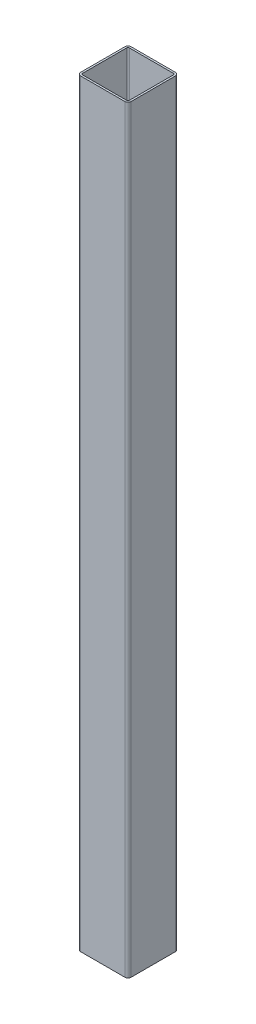
ISO-10303-21;
HEADER;
FILE_DESCRIPTION(('STEP AP214'),'2;1');
FILE_NAME('part.step','',(''),(''),'','','');
FILE_SCHEMA(('AUTOMOTIVE_DESIGN { 1 0 10303 214 1 1 1 1 }'));
ENDSEC;
DATA;
#1=APPLICATION_CONTEXT('core data for automotive mechanical design processes');
#2=APPLICATION_PROTOCOL_DEFINITION('international standard','automotive_design',2000,#1);
#3=PRODUCT_CONTEXT('',#1,'mechanical');
#4=PRODUCT('Part','Part','',(#3));
#5=PRODUCT_RELATED_PRODUCT_CATEGORY('part','',(#4));
#6=PRODUCT_DEFINITION_FORMATION('','',#4);
#7=PRODUCT_DEFINITION_CONTEXT('part definition',#1,'design');
#8=PRODUCT_DEFINITION('design','',#6,#7);
#9=PRODUCT_DEFINITION_SHAPE('','',#8);
#10=(LENGTH_UNIT() NAMED_UNIT(*) SI_UNIT(.MILLI.,.METRE.));
#11=(NAMED_UNIT(*) PLANE_ANGLE_UNIT() SI_UNIT($,.RADIAN.));
#12=(NAMED_UNIT(*) SI_UNIT($,.STERADIAN.) SOLID_ANGLE_UNIT());
#13=UNCERTAINTY_MEASURE_WITH_UNIT(LENGTH_MEASURE(1.E-05),#10,'distance_accuracy_value','');
#14=(GEOMETRIC_REPRESENTATION_CONTEXT(3) GLOBAL_UNCERTAINTY_ASSIGNED_CONTEXT((#13)) GLOBAL_UNIT_ASSIGNED_CONTEXT((#10,
#11,#12)) REPRESENTATION_CONTEXT('',''));
#15=CARTESIAN_POINT('',(0.,0.,0.));
#16=DIRECTION('',(0.,0.,1.));
#17=DIRECTION('',(1.,0.,0.));
#18=AXIS2_PLACEMENT_3D('',#15,#16,#17);
#19=CARTESIAN_POINT('',(35.,1200.,35.));
#20=DIRECTION('',(0.,1.,0.));
#21=DIRECTION('',(0.,0.,1.));
#22=AXIS2_PLACEMENT_3D('',#19,#20,#21);
#23=PLANE('',#22);
#24=CARTESIAN_POINT('',(35.,1200.,35.));
#25=DIRECTION('',(0.,1.,0.));
#26=DIRECTION('',(0.,0.,1.));
#27=AXIS2_PLACEMENT_3D('',#24,#25,#26);
#28=CIRCLE('',#27,5.);
#29=CARTESIAN_POINT('',(35.,1200.,40.));
#30=VERTEX_POINT('',#29);
#31=CARTESIAN_POINT('',(40.,1200.,35.));
#32=VERTEX_POINT('',#31);
#33=EDGE_CURVE('E263',#30,#32,#28,.T.);
#34=ORIENTED_EDGE('',*,*,#33,.T.);
#35=DIRECTION('',(0.,0.,-1.));
#36=VECTOR('',#35,1.);
#37=CARTESIAN_POINT('',(40.,1200.,-35.));
#38=LINE('',#37,#36);
#39=CARTESIAN_POINT('',(40.,1200.,-35.));
#40=VERTEX_POINT('',#39);
#41=EDGE_CURVE('E266',#32,#40,#38,.T.);
#42=ORIENTED_EDGE('',*,*,#41,.T.);
#43=CARTESIAN_POINT('',(35.,1200.,-35.));
#44=DIRECTION('',(0.,1.,0.));
#45=DIRECTION('',(0.,0.,-1.));
#46=AXIS2_PLACEMENT_3D('',#43,#44,#45);
#47=CIRCLE('',#46,5.);
#48=CARTESIAN_POINT('',(35.,1200.,-40.));
#49=VERTEX_POINT('',#48);
#50=EDGE_CURVE('E269',#40,#49,#47,.T.);
#51=ORIENTED_EDGE('',*,*,#50,.T.);
#52=DIRECTION('',(-1.,0.,0.));
#53=VECTOR('',#52,1.);
#54=CARTESIAN_POINT('',(-35.,1200.,-40.));
#55=LINE('',#54,#53);
#56=CARTESIAN_POINT('',(-35.,1200.,-40.));
#57=VERTEX_POINT('',#56);
#58=EDGE_CURVE('E271',#49,#57,#55,.T.);
#59=ORIENTED_EDGE('',*,*,#58,.T.);
#60=CARTESIAN_POINT('',(-35.,1200.,-35.));
#61=DIRECTION('',(0.,1.,0.));
#62=DIRECTION('',(0.,0.,1.));
#63=AXIS2_PLACEMENT_3D('',#60,#61,#62);
#64=CIRCLE('',#63,5.);
#65=CARTESIAN_POINT('',(-40.,1200.,-35.));
#66=VERTEX_POINT('',#65);
#67=EDGE_CURVE('E273',#57,#66,#64,.T.);
#68=ORIENTED_EDGE('',*,*,#67,.T.);
#69=DIRECTION('',(0.,0.,1.));
#70=VECTOR('',#69,1.);
#71=CARTESIAN_POINT('',(-40.,1200.,-35.));
#72=LINE('',#71,#70);
#73=CARTESIAN_POINT('',(-40.,1200.,35.));
#74=VERTEX_POINT('',#73);
#75=EDGE_CURVE('E275',#66,#74,#72,.T.);
#76=ORIENTED_EDGE('',*,*,#75,.T.);
#77=CARTESIAN_POINT('',(-35.,1200.,35.));
#78=DIRECTION('',(0.,1.,0.));
#79=DIRECTION('',(0.,0.,1.));
#80=AXIS2_PLACEMENT_3D('',#77,#78,#79);
#81=CIRCLE('',#80,5.);
#82=CARTESIAN_POINT('',(-35.,1200.,40.));
#83=VERTEX_POINT('',#82);
#84=EDGE_CURVE('E277',#74,#83,#81,.T.);
#85=ORIENTED_EDGE('',*,*,#84,.T.);
#86=DIRECTION('',(1.,0.,0.));
#87=VECTOR('',#86,1.);
#88=CARTESIAN_POINT('',(-35.,1200.,40.));
#89=LINE('',#88,#87);
#90=EDGE_CURVE('E279',#83,#30,#89,.T.);
#91=ORIENTED_EDGE('',*,*,#90,.T.);
#92=EDGE_LOOP('',(#34,#42,#51,#59,#68,#76,#85,#91));
#93=FACE_BOUND('',#92,.T.);
#94=DIRECTION('',(0.,0.,-1.));
#95=VECTOR('',#94,1.);
#96=CARTESIAN_POINT('',(37.,1200.,-35.));
#97=LINE('',#96,#95);
#98=CARTESIAN_POINT('',(37.,1200.,35.));
#99=VERTEX_POINT('',#98);
#100=CARTESIAN_POINT('',(37.,1200.,-35.));
#101=VERTEX_POINT('',#100);
#102=EDGE_CURVE('E206',#99,#101,#97,.T.);
#103=ORIENTED_EDGE('',*,*,#102,.F.);
#104=CARTESIAN_POINT('',(35.,1200.,35.));
#105=DIRECTION('',(0.,1.,0.));
#106=DIRECTION('',(1.,0.,0.));
#107=AXIS2_PLACEMENT_3D('',#104,#105,#106);
#108=CIRCLE('',#107,2.);
#109=CARTESIAN_POINT('',(35.,1200.,37.));
#110=VERTEX_POINT('',#109);
#111=EDGE_CURVE('E198',#110,#99,#108,.T.);
#112=ORIENTED_EDGE('',*,*,#111,.F.);
#113=DIRECTION('',(1.,0.,0.));
#114=VECTOR('',#113,1.);
#115=CARTESIAN_POINT('',(-35.,1200.,37.));
#116=LINE('',#115,#114);
#117=CARTESIAN_POINT('',(-35.,1200.,37.));
#118=VERTEX_POINT('',#117);
#119=EDGE_CURVE('E231',#118,#110,#116,.T.);
#120=ORIENTED_EDGE('',*,*,#119,.F.);
#121=CARTESIAN_POINT('',(-35.,1200.,35.));
#122=DIRECTION('',(0.,1.,0.));
#123=DIRECTION('',(1.,0.,0.));
#124=AXIS2_PLACEMENT_3D('',#121,#122,#123);
#125=CIRCLE('',#124,2.);
#126=CARTESIAN_POINT('',(-37.,1200.,35.));
#127=VERTEX_POINT('',#126);
#128=EDGE_CURVE('E229',#127,#118,#125,.T.);
#129=ORIENTED_EDGE('',*,*,#128,.F.);
#130=DIRECTION('',(0.,0.,1.));
#131=VECTOR('',#130,1.);
#132=CARTESIAN_POINT('',(-37.,1200.,-35.));
#133=LINE('',#132,#131);
#134=CARTESIAN_POINT('',(-37.,1200.,-35.));
#135=VERTEX_POINT('',#134);
#136=EDGE_CURVE('E227',#135,#127,#133,.T.);
#137=ORIENTED_EDGE('',*,*,#136,.F.);
#138=CARTESIAN_POINT('',(-35.,1200.,-35.));
#139=DIRECTION('',(0.,1.,0.));
#140=DIRECTION('',(1.,0.,0.));
#141=AXIS2_PLACEMENT_3D('',#138,#139,#140);
#142=CIRCLE('',#141,2.);
#143=CARTESIAN_POINT('',(-35.,1200.,-37.));
#144=VERTEX_POINT('',#143);
#145=EDGE_CURVE('E225',#144,#135,#142,.T.);
#146=ORIENTED_EDGE('',*,*,#145,.F.);
#147=DIRECTION('',(-1.,0.,0.));
#148=VECTOR('',#147,1.);
#149=CARTESIAN_POINT('',(-35.,1200.,-37.));
#150=LINE('',#149,#148);
#151=CARTESIAN_POINT('',(35.,1200.,-37.));
#152=VERTEX_POINT('',#151);
#153=EDGE_CURVE('E221',#152,#144,#150,.T.);
#154=ORIENTED_EDGE('',*,*,#153,.F.);
#155=CARTESIAN_POINT('',(35.,1200.,-35.));
#156=DIRECTION('',(0.,1.,0.));
#157=DIRECTION('',(1.,0.,0.));
#158=AXIS2_PLACEMENT_3D('',#155,#156,#157);
#159=CIRCLE('',#158,2.);
#160=EDGE_CURVE('E219',#101,#152,#159,.T.);
#161=ORIENTED_EDGE('',*,*,#160,.F.);
#162=EDGE_LOOP('',(#103,#112,#120,#129,#137,#146,#154,#161));
#163=FACE_BOUND('',#162,.T.);
#164=ADVANCED_FACE('F85',(#93,#163),#23,.T.);
#165=CARTESIAN_POINT('',(35.,0.,35.));
#166=DIRECTION('',(0.,1.,0.));
#167=DIRECTION('',(0.,0.,1.));
#168=AXIS2_PLACEMENT_3D('',#165,#166,#167);
#169=PLANE('',#168);
#170=CARTESIAN_POINT('',(35.,0.,35.));
#171=DIRECTION('',(0.,1.,0.));
#172=DIRECTION('',(0.,0.,1.));
#173=AXIS2_PLACEMENT_3D('',#170,#171,#172);
#174=CIRCLE('',#173,5.);
#175=CARTESIAN_POINT('',(35.,0.,40.));
#176=VERTEX_POINT('',#175);
#177=CARTESIAN_POINT('',(40.,0.,35.));
#178=VERTEX_POINT('',#177);
#179=EDGE_CURVE('E214',#176,#178,#174,.T.);
#180=ORIENTED_EDGE('',*,*,#179,.F.);
#181=DIRECTION('',(1.,0.,0.));
#182=VECTOR('',#181,1.);
#183=CARTESIAN_POINT('',(-35.,0.,40.));
#184=LINE('',#183,#182);
#185=CARTESIAN_POINT('',(-35.,0.,40.));
#186=VERTEX_POINT('',#185);
#187=EDGE_CURVE('E267',#186,#176,#184,.T.);
#188=ORIENTED_EDGE('',*,*,#187,.F.);
#189=CARTESIAN_POINT('',(-35.,0.,35.));
#190=DIRECTION('',(0.,1.,0.));
#191=DIRECTION('',(0.,0.,1.));
#192=AXIS2_PLACEMENT_3D('',#189,#190,#191);
#193=CIRCLE('',#192,5.);
#194=CARTESIAN_POINT('',(-40.,0.,35.));
#195=VERTEX_POINT('',#194);
#196=EDGE_CURVE('E294',#195,#186,#193,.T.);
#197=ORIENTED_EDGE('',*,*,#196,.F.);
#198=DIRECTION('',(0.,0.,1.));
#199=VECTOR('',#198,1.);
#200=CARTESIAN_POINT('',(-40.,0.,-35.));
#201=LINE('',#200,#199);
#202=CARTESIAN_POINT('',(-40.,0.,-35.));
#203=VERTEX_POINT('',#202);
#204=EDGE_CURVE('E292',#203,#195,#201,.T.);
#205=ORIENTED_EDGE('',*,*,#204,.F.);
#206=CARTESIAN_POINT('',(-35.,0.,-35.));
#207=DIRECTION('',(0.,1.,0.));
#208=DIRECTION('',(0.,0.,1.));
#209=AXIS2_PLACEMENT_3D('',#206,#207,#208);
#210=CIRCLE('',#209,5.);
#211=CARTESIAN_POINT('',(-35.,0.,-40.));
#212=VERTEX_POINT('',#211);
#213=EDGE_CURVE('E290',#212,#203,#210,.T.);
#214=ORIENTED_EDGE('',*,*,#213,.F.);
#215=DIRECTION('',(-1.,0.,0.));
#216=VECTOR('',#215,1.);
#217=CARTESIAN_POINT('',(-35.,0.,-40.));
#218=LINE('',#217,#216);
#219=CARTESIAN_POINT('',(35.,0.,-40.));
#220=VERTEX_POINT('',#219);
#221=EDGE_CURVE('E288',#220,#212,#218,.T.);
#222=ORIENTED_EDGE('',*,*,#221,.F.);
#223=CARTESIAN_POINT('',(35.,0.,-35.));
#224=DIRECTION('',(0.,1.,0.));
#225=DIRECTION('',(0.,0.,-1.));
#226=AXIS2_PLACEMENT_3D('',#223,#224,#225);
#227=CIRCLE('',#226,5.);
#228=CARTESIAN_POINT('',(40.,0.,-35.));
#229=VERTEX_POINT('',#228);
#230=EDGE_CURVE('E286',#229,#220,#227,.T.);
#231=ORIENTED_EDGE('',*,*,#230,.F.);
#232=DIRECTION('',(0.,0.,-1.));
#233=VECTOR('',#232,1.);
#234=CARTESIAN_POINT('',(40.,0.,-35.));
#235=LINE('',#234,#233);
#236=EDGE_CURVE('E284',#178,#229,#235,.T.);
#237=ORIENTED_EDGE('',*,*,#236,.F.);
#238=EDGE_LOOP('',(#180,#188,#197,#205,#214,#222,#231,#237));
#239=FACE_BOUND('',#238,.T.);
#240=CARTESIAN_POINT('',(35.,0.,35.));
#241=DIRECTION('',(0.,1.,0.));
#242=DIRECTION('',(1.,0.,0.));
#243=AXIS2_PLACEMENT_3D('',#240,#241,#242);
#244=CIRCLE('',#243,2.);
#245=CARTESIAN_POINT('',(35.,0.,37.));
#246=VERTEX_POINT('',#245);
#247=CARTESIAN_POINT('',(37.,0.,35.));
#248=VERTEX_POINT('',#247);
#249=EDGE_CURVE('E108',#246,#248,#244,.T.);
#250=ORIENTED_EDGE('',*,*,#249,.T.);
#251=DIRECTION('',(0.,0.,-1.));
#252=VECTOR('',#251,1.);
#253=CARTESIAN_POINT('',(37.,0.,-35.));
#254=LINE('',#253,#252);
#255=CARTESIAN_POINT('',(37.,0.,-35.));
#256=VERTEX_POINT('',#255);
#257=EDGE_CURVE('E213',#248,#256,#254,.T.);
#258=ORIENTED_EDGE('',*,*,#257,.T.);
#259=CARTESIAN_POINT('',(35.,0.,-35.));
#260=DIRECTION('',(0.,1.,0.));
#261=DIRECTION('',(1.,0.,0.));
#262=AXIS2_PLACEMENT_3D('',#259,#260,#261);
#263=CIRCLE('',#262,2.);
#264=CARTESIAN_POINT('',(35.,0.,-37.));
#265=VERTEX_POINT('',#264);
#266=EDGE_CURVE('E235',#256,#265,#263,.T.);
#267=ORIENTED_EDGE('',*,*,#266,.T.);
#268=DIRECTION('',(-1.,0.,0.));
#269=VECTOR('',#268,1.);
#270=CARTESIAN_POINT('',(-35.,0.,-37.));
#271=LINE('',#270,#269);
#272=CARTESIAN_POINT('',(-35.,0.,-37.));
#273=VERTEX_POINT('',#272);
#274=EDGE_CURVE('E238',#265,#273,#271,.T.);
#275=ORIENTED_EDGE('',*,*,#274,.T.);
#276=CARTESIAN_POINT('',(-35.,0.,-35.));
#277=DIRECTION('',(0.,1.,0.));
#278=DIRECTION('',(1.,0.,0.));
#279=AXIS2_PLACEMENT_3D('',#276,#277,#278);
#280=CIRCLE('',#279,2.);
#281=CARTESIAN_POINT('',(-37.,0.,-35.));
#282=VERTEX_POINT('',#281);
#283=EDGE_CURVE('E241',#273,#282,#280,.T.);
#284=ORIENTED_EDGE('',*,*,#283,.T.);
#285=DIRECTION('',(0.,0.,1.));
#286=VECTOR('',#285,1.);
#287=CARTESIAN_POINT('',(-37.,0.,-35.));
#288=LINE('',#287,#286);
#289=CARTESIAN_POINT('',(-37.,0.,35.));
#290=VERTEX_POINT('',#289);
#291=EDGE_CURVE('E244',#282,#290,#288,.T.);
#292=ORIENTED_EDGE('',*,*,#291,.T.);
#293=CARTESIAN_POINT('',(-35.,0.,35.));
#294=DIRECTION('',(0.,1.,0.));
#295=DIRECTION('',(1.,0.,0.));
#296=AXIS2_PLACEMENT_3D('',#293,#294,#295);
#297=CIRCLE('',#296,2.);
#298=CARTESIAN_POINT('',(-35.,0.,37.));
#299=VERTEX_POINT('',#298);
#300=EDGE_CURVE('E247',#290,#299,#297,.T.);
#301=ORIENTED_EDGE('',*,*,#300,.T.);
#302=DIRECTION('',(1.,0.,0.));
#303=VECTOR('',#302,1.);
#304=CARTESIAN_POINT('',(-35.,0.,37.));
#305=LINE('',#304,#303);
#306=EDGE_CURVE('E207',#299,#246,#305,.T.);
#307=ORIENTED_EDGE('',*,*,#306,.T.);
#308=EDGE_LOOP('',(#250,#258,#267,#275,#284,#292,#301,#307));
#309=FACE_BOUND('',#308,.T.);
#310=ADVANCED_FACE('F324',(#239,#309),#169,.F.);
#311=CARTESIAN_POINT('',(35.,1200.,35.));
#312=DIRECTION('',(0.,-1.,0.));
#313=DIRECTION('',(0.,0.,-1.));
#314=AXIS2_PLACEMENT_3D('',#311,#312,#313);
#315=CYLINDRICAL_SURFACE('',#314,5.);
#316=ORIENTED_EDGE('',*,*,#179,.T.);
#317=DIRECTION('',(0.,-1.,0.));
#318=VECTOR('',#317,1.);
#319=CARTESIAN_POINT('',(40.,1200.,35.));
#320=LINE('',#319,#318);
#321=EDGE_CURVE('E12',#32,#178,#320,.T.);
#322=ORIENTED_EDGE('',*,*,#321,.F.);
#323=ORIENTED_EDGE('',*,*,#33,.F.);
#324=DIRECTION('',(0.,-1.,0.));
#325=VECTOR('',#324,1.);
#326=CARTESIAN_POINT('',(35.,1200.,40.));
#327=LINE('',#326,#325);
#328=EDGE_CURVE('E281',#30,#176,#327,.T.);
#329=ORIENTED_EDGE('',*,*,#328,.T.);
#330=EDGE_LOOP('',(#316,#322,#323,#329));
#331=FACE_BOUND('',#330,.T.);
#332=ADVANCED_FACE('F87',(#331),#315,.T.);
#333=CARTESIAN_POINT('',(40.,1200.,-35.));
#334=DIRECTION('',(-1.,0.,0.));
#335=DIRECTION('',(0.,0.,1.));
#336=AXIS2_PLACEMENT_3D('',#333,#334,#335);
#337=PLANE('',#336);
#338=ORIENTED_EDGE('',*,*,#236,.T.);
#339=DIRECTION('',(0.,-1.,0.));
#340=VECTOR('',#339,1.);
#341=CARTESIAN_POINT('',(40.,1200.,-35.));
#342=LINE('',#341,#340);
#343=EDGE_CURVE('E93',#40,#229,#342,.T.);
#344=ORIENTED_EDGE('',*,*,#343,.F.);
#345=ORIENTED_EDGE('',*,*,#41,.F.);
#346=ORIENTED_EDGE('',*,*,#321,.T.);
#347=EDGE_LOOP('',(#338,#344,#345,#346));
#348=FACE_BOUND('',#347,.T.);
#349=ADVANCED_FACE('F341',(#348),#337,.F.);
#350=CARTESIAN_POINT('',(35.,1200.,-35.));
#351=DIRECTION('',(0.,-1.,0.));
#352=DIRECTION('',(0.,0.,-1.));
#353=AXIS2_PLACEMENT_3D('',#350,#351,#352);
#354=CYLINDRICAL_SURFACE('',#353,5.);
#355=ORIENTED_EDGE('',*,*,#230,.T.);
#356=DIRECTION('',(0.,-1.,0.));
#357=VECTOR('',#356,1.);
#358=CARTESIAN_POINT('',(35.,1200.,-40.));
#359=LINE('',#358,#357);
#360=EDGE_CURVE('E311',#49,#220,#359,.T.);
#361=ORIENTED_EDGE('',*,*,#360,.F.);
#362=ORIENTED_EDGE('',*,*,#50,.F.);
#363=ORIENTED_EDGE('',*,*,#343,.T.);
#364=EDGE_LOOP('',(#355,#361,#362,#363));
#365=FACE_BOUND('',#364,.T.);
#366=ADVANCED_FACE('F318',(#365),#354,.T.);
#367=CARTESIAN_POINT('',(-35.,1200.,-40.));
#368=DIRECTION('',(0.,0.,1.));
#369=DIRECTION('',(1.,0.,0.));
#370=AXIS2_PLACEMENT_3D('',#367,#368,#369);
#371=PLANE('',#370);
#372=ORIENTED_EDGE('',*,*,#221,.T.);
#373=DIRECTION('',(0.,-1.,0.));
#374=VECTOR('',#373,1.);
#375=CARTESIAN_POINT('',(-35.,1200.,-40.));
#376=LINE('',#375,#374);
#377=EDGE_CURVE('E308',#57,#212,#376,.T.);
#378=ORIENTED_EDGE('',*,*,#377,.F.);
#379=ORIENTED_EDGE('',*,*,#58,.F.);
#380=ORIENTED_EDGE('',*,*,#360,.T.);
#381=EDGE_LOOP('',(#372,#378,#379,#380));
#382=FACE_BOUND('',#381,.T.);
#383=ADVANCED_FACE('F330',(#382),#371,.F.);
#384=CARTESIAN_POINT('',(-35.,1200.,-35.));
#385=DIRECTION('',(0.,-1.,0.));
#386=DIRECTION('',(0.,0.,-1.));
#387=AXIS2_PLACEMENT_3D('',#384,#385,#386);
#388=CYLINDRICAL_SURFACE('',#387,5.);
#389=ORIENTED_EDGE('',*,*,#213,.T.);
#390=DIRECTION('',(0.,-1.,0.));
#391=VECTOR('',#390,1.);
#392=CARTESIAN_POINT('',(-40.,1200.,-35.));
#393=LINE('',#392,#391);
#394=EDGE_CURVE('E305',#66,#203,#393,.T.);
#395=ORIENTED_EDGE('',*,*,#394,.F.);
#396=ORIENTED_EDGE('',*,*,#67,.F.);
#397=ORIENTED_EDGE('',*,*,#377,.T.);
#398=EDGE_LOOP('',(#389,#395,#396,#397));
#399=FACE_BOUND('',#398,.T.);
#400=ADVANCED_FACE('F334',(#399),#388,.T.);
#401=CARTESIAN_POINT('',(-40.,1200.,-35.));
#402=DIRECTION('',(1.,0.,0.));
#403=DIRECTION('',(0.,0.,-1.));
#404=AXIS2_PLACEMENT_3D('',#401,#402,#403);
#405=PLANE('',#404);
#406=ORIENTED_EDGE('',*,*,#204,.T.);
#407=DIRECTION('',(0.,-1.,0.));
#408=VECTOR('',#407,1.);
#409=CARTESIAN_POINT('',(-40.,1200.,35.));
#410=LINE('',#409,#408);
#411=EDGE_CURVE('E302',#74,#195,#410,.T.);
#412=ORIENTED_EDGE('',*,*,#411,.F.);
#413=ORIENTED_EDGE('',*,*,#75,.F.);
#414=ORIENTED_EDGE('',*,*,#394,.T.);
#415=EDGE_LOOP('',(#406,#412,#413,#414));
#416=FACE_BOUND('',#415,.T.);
#417=ADVANCED_FACE('F354',(#416),#405,.F.);
#418=CARTESIAN_POINT('',(-35.,1200.,35.));
#419=DIRECTION('',(0.,-1.,0.));
#420=DIRECTION('',(0.,0.,-1.));
#421=AXIS2_PLACEMENT_3D('',#418,#419,#420);
#422=CYLINDRICAL_SURFACE('',#421,5.);
#423=ORIENTED_EDGE('',*,*,#196,.T.);
#424=DIRECTION('',(0.,-1.,0.));
#425=VECTOR('',#424,1.);
#426=CARTESIAN_POINT('',(-35.,1200.,40.));
#427=LINE('',#426,#425);
#428=EDGE_CURVE('E299',#83,#186,#427,.T.);
#429=ORIENTED_EDGE('',*,*,#428,.F.);
#430=ORIENTED_EDGE('',*,*,#84,.F.);
#431=ORIENTED_EDGE('',*,*,#411,.T.);
#432=EDGE_LOOP('',(#423,#429,#430,#431));
#433=FACE_BOUND('',#432,.T.);
#434=ADVANCED_FACE('F352',(#433),#422,.T.);
#435=CARTESIAN_POINT('',(-35.,1200.,40.));
#436=DIRECTION('',(0.,0.,-1.));
#437=DIRECTION('',(-1.,0.,0.));
#438=AXIS2_PLACEMENT_3D('',#435,#436,#437);
#439=PLANE('',#438);
#440=ORIENTED_EDGE('',*,*,#187,.T.);
#441=ORIENTED_EDGE('',*,*,#328,.F.);
#442=ORIENTED_EDGE('',*,*,#90,.F.);
#443=ORIENTED_EDGE('',*,*,#428,.T.);
#444=EDGE_LOOP('',(#440,#441,#442,#443));
#445=FACE_BOUND('',#444,.T.);
#446=ADVANCED_FACE('F347',(#445),#439,.F.);
#447=CARTESIAN_POINT('',(35.,1200.,35.));
#448=DIRECTION('',(0.,-1.,0.));
#449=DIRECTION('',(0.,0.,-1.));
#450=AXIS2_PLACEMENT_3D('',#447,#448,#449);
#451=CYLINDRICAL_SURFACE('',#450,2.);
#452=ORIENTED_EDGE('',*,*,#249,.F.);
#453=DIRECTION('',(0.,-1.,0.));
#454=VECTOR('',#453,1.);
#455=CARTESIAN_POINT('',(35.,1200.,37.));
#456=LINE('',#455,#454);
#457=EDGE_CURVE('E202',#110,#246,#456,.T.);
#458=ORIENTED_EDGE('',*,*,#457,.F.);
#459=ORIENTED_EDGE('',*,*,#111,.T.);
#460=DIRECTION('',(0.,-1.,0.));
#461=VECTOR('',#460,1.);
#462=CARTESIAN_POINT('',(37.,1200.,35.));
#463=LINE('',#462,#461);
#464=EDGE_CURVE('E201',#99,#248,#463,.T.);
#465=ORIENTED_EDGE('',*,*,#464,.T.);
#466=EDGE_LOOP('',(#452,#458,#459,#465));
#467=FACE_BOUND('',#466,.T.);
#468=ADVANCED_FACE('F200',(#467),#451,.F.);
#469=CARTESIAN_POINT('',(37.,1200.,-35.));
#470=DIRECTION('',(-1.,0.,0.));
#471=DIRECTION('',(0.,0.,1.));
#472=AXIS2_PLACEMENT_3D('',#469,#470,#471);
#473=PLANE('',#472);
#474=ORIENTED_EDGE('',*,*,#257,.F.);
#475=ORIENTED_EDGE('',*,*,#464,.F.);
#476=ORIENTED_EDGE('',*,*,#102,.T.);
#477=DIRECTION('',(0.,-1.,0.));
#478=VECTOR('',#477,1.);
#479=CARTESIAN_POINT('',(37.,1200.,-35.));
#480=LINE('',#479,#478);
#481=EDGE_CURVE('E215',#101,#256,#480,.T.);
#482=ORIENTED_EDGE('',*,*,#481,.T.);
#483=EDGE_LOOP('',(#474,#475,#476,#482));
#484=FACE_BOUND('',#483,.T.);
#485=ADVANCED_FACE('F210',(#484),#473,.T.);
#486=CARTESIAN_POINT('',(35.,1200.,-35.));
#487=DIRECTION('',(0.,-1.,0.));
#488=DIRECTION('',(0.,0.,-1.));
#489=AXIS2_PLACEMENT_3D('',#486,#487,#488);
#490=CYLINDRICAL_SURFACE('',#489,2.);
#491=ORIENTED_EDGE('',*,*,#266,.F.);
#492=ORIENTED_EDGE('',*,*,#481,.F.);
#493=ORIENTED_EDGE('',*,*,#160,.T.);
#494=DIRECTION('',(0.,-1.,0.));
#495=VECTOR('',#494,1.);
#496=CARTESIAN_POINT('',(35.,1200.,-37.));
#497=LINE('',#496,#495);
#498=EDGE_CURVE('E260',#152,#265,#497,.T.);
#499=ORIENTED_EDGE('',*,*,#498,.T.);
#500=EDGE_LOOP('',(#491,#492,#493,#499));
#501=FACE_BOUND('',#500,.T.);
#502=ADVANCED_FACE('F379',(#501),#490,.F.);
#503=CARTESIAN_POINT('',(-35.,1200.,-37.));
#504=DIRECTION('',(0.,0.,1.));
#505=DIRECTION('',(1.,0.,0.));
#506=AXIS2_PLACEMENT_3D('',#503,#504,#505);
#507=PLANE('',#506);
#508=ORIENTED_EDGE('',*,*,#274,.F.);
#509=ORIENTED_EDGE('',*,*,#498,.F.);
#510=ORIENTED_EDGE('',*,*,#153,.T.);
#511=DIRECTION('',(0.,-1.,0.));
#512=VECTOR('',#511,1.);
#513=CARTESIAN_POINT('',(-35.,1200.,-37.));
#514=LINE('',#513,#512);
#515=EDGE_CURVE('E258',#144,#273,#514,.T.);
#516=ORIENTED_EDGE('',*,*,#515,.T.);
#517=EDGE_LOOP('',(#508,#509,#510,#516));
#518=FACE_BOUND('',#517,.T.);
#519=ADVANCED_FACE('F383',(#518),#507,.T.);
#520=CARTESIAN_POINT('',(-35.,1200.,-35.));
#521=DIRECTION('',(0.,-1.,0.));
#522=DIRECTION('',(0.,0.,-1.));
#523=AXIS2_PLACEMENT_3D('',#520,#521,#522);
#524=CYLINDRICAL_SURFACE('',#523,2.);
#525=ORIENTED_EDGE('',*,*,#283,.F.);
#526=ORIENTED_EDGE('',*,*,#515,.F.);
#527=ORIENTED_EDGE('',*,*,#145,.T.);
#528=DIRECTION('',(0.,-1.,0.));
#529=VECTOR('',#528,1.);
#530=CARTESIAN_POINT('',(-37.,1200.,-35.));
#531=LINE('',#530,#529);
#532=EDGE_CURVE('E256',#135,#282,#531,.T.);
#533=ORIENTED_EDGE('',*,*,#532,.T.);
#534=EDGE_LOOP('',(#525,#526,#527,#533));
#535=FACE_BOUND('',#534,.T.);
#536=ADVANCED_FACE('F389',(#535),#524,.F.);
#537=CARTESIAN_POINT('',(-37.,1200.,-35.));
#538=DIRECTION('',(1.,0.,0.));
#539=DIRECTION('',(0.,0.,-1.));
#540=AXIS2_PLACEMENT_3D('',#537,#538,#539);
#541=PLANE('',#540);
#542=ORIENTED_EDGE('',*,*,#291,.F.);
#543=ORIENTED_EDGE('',*,*,#532,.F.);
#544=ORIENTED_EDGE('',*,*,#136,.T.);
#545=DIRECTION('',(0.,-1.,0.));
#546=VECTOR('',#545,1.);
#547=CARTESIAN_POINT('',(-37.,1200.,35.));
#548=LINE('',#547,#546);
#549=EDGE_CURVE('E254',#127,#290,#548,.T.);
#550=ORIENTED_EDGE('',*,*,#549,.T.);
#551=EDGE_LOOP('',(#542,#543,#544,#550));
#552=FACE_BOUND('',#551,.T.);
#553=ADVANCED_FACE('F393',(#552),#541,.T.);
#554=CARTESIAN_POINT('',(-35.,1200.,35.));
#555=DIRECTION('',(0.,-1.,0.));
#556=DIRECTION('',(0.,0.,-1.));
#557=AXIS2_PLACEMENT_3D('',#554,#555,#556);
#558=CYLINDRICAL_SURFACE('',#557,2.);
#559=ORIENTED_EDGE('',*,*,#300,.F.);
#560=ORIENTED_EDGE('',*,*,#549,.F.);
#561=ORIENTED_EDGE('',*,*,#128,.T.);
#562=DIRECTION('',(0.,-1.,0.));
#563=VECTOR('',#562,1.);
#564=CARTESIAN_POINT('',(-35.,1200.,37.));
#565=LINE('',#564,#563);
#566=EDGE_CURVE('E100',#118,#299,#565,.T.);
#567=ORIENTED_EDGE('',*,*,#566,.T.);
#568=EDGE_LOOP('',(#559,#560,#561,#567));
#569=FACE_BOUND('',#568,.T.);
#570=ADVANCED_FACE('F397',(#569),#558,.F.);
#571=CARTESIAN_POINT('',(-35.,1200.,37.));
#572=DIRECTION('',(0.,0.,-1.));
#573=DIRECTION('',(-1.,0.,0.));
#574=AXIS2_PLACEMENT_3D('',#571,#572,#573);
#575=PLANE('',#574);
#576=ORIENTED_EDGE('',*,*,#306,.F.);
#577=ORIENTED_EDGE('',*,*,#566,.F.);
#578=ORIENTED_EDGE('',*,*,#119,.T.);
#579=ORIENTED_EDGE('',*,*,#457,.T.);
#580=EDGE_LOOP('',(#576,#577,#578,#579));
#581=FACE_BOUND('',#580,.T.);
#582=ADVANCED_FACE('F401',(#581),#575,.T.);
#583=CLOSED_SHELL('',(#164,#310,#332,#349,#366,#383,#400,#417,#434,#446,#468,#485,#502,#519,
#536,#553,#570,#582));
#584=MANIFOLD_SOLID_BREP('B2',#583);
#585=ADVANCED_BREP_SHAPE_REPRESENTATION('',(#18,#584),#14);
#586=SHAPE_DEFINITION_REPRESENTATION(#9,#585);
ENDSEC;
END-ISO-10303-21;
